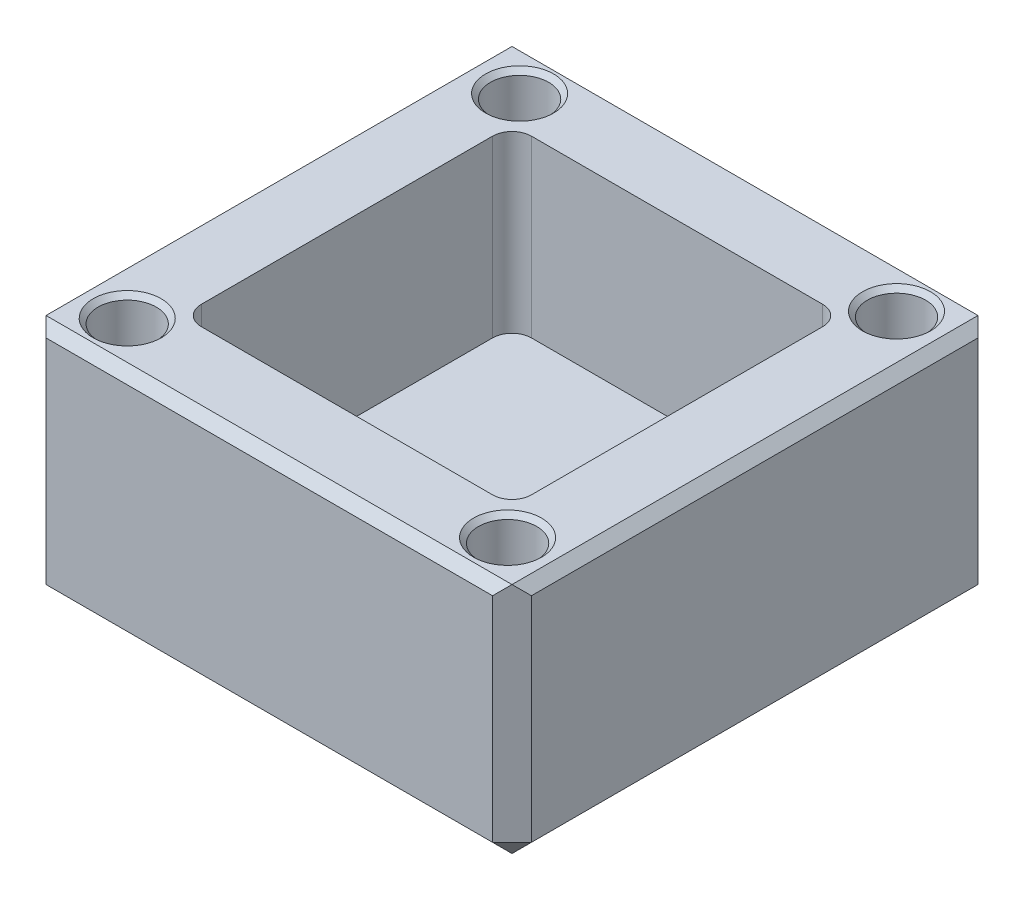
ISO-10303-21;
HEADER;
FILE_DESCRIPTION(('STEP AP214'),'2;1');
FILE_NAME('part.step','',(''),(''),'','','');
FILE_SCHEMA(('AUTOMOTIVE_DESIGN { 1 0 10303 214 1 1 1 1 }'));
ENDSEC;
DATA;
#1=APPLICATION_CONTEXT('core data for automotive mechanical design processes');
#2=APPLICATION_PROTOCOL_DEFINITION('international standard','automotive_design',2000,#1);
#3=PRODUCT_CONTEXT('',#1,'mechanical');
#4=PRODUCT('Part','Part','',(#3));
#5=PRODUCT_RELATED_PRODUCT_CATEGORY('part','',(#4));
#6=PRODUCT_DEFINITION_FORMATION('','',#4);
#7=PRODUCT_DEFINITION_CONTEXT('part definition',#1,'design');
#8=PRODUCT_DEFINITION('design','',#6,#7);
#9=PRODUCT_DEFINITION_SHAPE('','',#8);
#10=(LENGTH_UNIT() NAMED_UNIT(*) SI_UNIT(.MILLI.,.METRE.));
#11=(NAMED_UNIT(*) PLANE_ANGLE_UNIT() SI_UNIT($,.RADIAN.));
#12=(NAMED_UNIT(*) SI_UNIT($,.STERADIAN.) SOLID_ANGLE_UNIT());
#13=UNCERTAINTY_MEASURE_WITH_UNIT(LENGTH_MEASURE(1.E-05),#10,'distance_accuracy_value','');
#14=(GEOMETRIC_REPRESENTATION_CONTEXT(3) GLOBAL_UNCERTAINTY_ASSIGNED_CONTEXT((#13)) GLOBAL_UNIT_ASSIGNED_CONTEXT((#10,
#11,#12)) REPRESENTATION_CONTEXT('',''));
#15=CARTESIAN_POINT('',(0.,0.,0.));
#16=DIRECTION('',(0.,0.,1.));
#17=DIRECTION('',(1.,0.,0.));
#18=AXIS2_PLACEMENT_3D('',#15,#16,#17);
#19=CARTESIAN_POINT('',(25.,25.,-25.));
#20=DIRECTION('',(-1.,0.,0.));
#21=DIRECTION('',(0.,0.,1.));
#22=AXIS2_PLACEMENT_3D('',#19,#20,#21);
#23=PLANE('',#22);
#24=DIRECTION('',(0.,1.,0.));
#25=VECTOR('',#24,1.);
#26=CARTESIAN_POINT('',(25.,25.,-23.));
#27=LINE('',#26,#25);
#28=CARTESIAN_POINT('',(25.,2.,-23.));
#29=VERTEX_POINT('',#28);
#30=CARTESIAN_POINT('',(25.,24.,-23.));
#31=VERTEX_POINT('',#30);
#32=EDGE_CURVE('E198',#29,#31,#27,.T.);
#33=ORIENTED_EDGE('',*,*,#32,.T.);
#34=DIRECTION('',(0.,0.,1.));
#35=VECTOR('',#34,1.);
#36=CARTESIAN_POINT('',(25.,24.,23.));
#37=LINE('',#36,#35);
#38=CARTESIAN_POINT('',(25.,24.,23.));
#39=VERTEX_POINT('',#38);
#40=EDGE_CURVE('E309',#31,#39,#37,.T.);
#41=ORIENTED_EDGE('',*,*,#40,.T.);
#42=DIRECTION('',(0.,-1.,0.));
#43=VECTOR('',#42,1.);
#44=CARTESIAN_POINT('',(25.,25.,23.));
#45=LINE('',#44,#43);
#46=CARTESIAN_POINT('',(25.,2.,23.));
#47=VERTEX_POINT('',#46);
#48=EDGE_CURVE('E237',#39,#47,#45,.T.);
#49=ORIENTED_EDGE('',*,*,#48,.T.);
#50=DIRECTION('',(0.,0.,-1.));
#51=VECTOR('',#50,1.);
#52=CARTESIAN_POINT('',(25.,2.,-25.));
#53=LINE('',#52,#51);
#54=EDGE_CURVE('E239',#47,#29,#53,.T.);
#55=ORIENTED_EDGE('',*,*,#54,.T.);
#56=EDGE_LOOP('',(#33,#41,#49,#55));
#57=FACE_BOUND('',#56,.T.);
#58=ADVANCED_FACE('F39',(#57),#23,.F.);
#59=CARTESIAN_POINT('',(-25.,25.,-25.));
#60=DIRECTION('',(0.,0.,1.));
#61=DIRECTION('',(1.,0.,0.));
#62=AXIS2_PLACEMENT_3D('',#59,#60,#61);
#63=PLANE('',#62);
#64=DIRECTION('',(0.,1.,0.));
#65=VECTOR('',#64,1.);
#66=CARTESIAN_POINT('',(-23.,25.,-25.));
#67=LINE('',#66,#65);
#68=CARTESIAN_POINT('',(-23.,2.,-25.));
#69=VERTEX_POINT('',#68);
#70=CARTESIAN_POINT('',(-23.,24.,-25.));
#71=VERTEX_POINT('',#70);
#72=EDGE_CURVE('E216',#69,#71,#67,.T.);
#73=ORIENTED_EDGE('',*,*,#72,.T.);
#74=DIRECTION('',(1.,0.,0.));
#75=VECTOR('',#74,1.);
#76=CARTESIAN_POINT('',(23.,24.,-25.));
#77=LINE('',#76,#75);
#78=CARTESIAN_POINT('',(23.,24.,-25.));
#79=VERTEX_POINT('',#78);
#80=EDGE_CURVE('E186',#71,#79,#77,.T.);
#81=ORIENTED_EDGE('',*,*,#80,.T.);
#82=DIRECTION('',(0.,-1.,0.));
#83=VECTOR('',#82,1.);
#84=CARTESIAN_POINT('',(23.,25.,-25.));
#85=LINE('',#84,#83);
#86=CARTESIAN_POINT('',(23.,2.,-25.));
#87=VERTEX_POINT('',#86);
#88=EDGE_CURVE('E179',#79,#87,#85,.T.);
#89=ORIENTED_EDGE('',*,*,#88,.T.);
#90=DIRECTION('',(-1.,0.,0.));
#91=VECTOR('',#90,1.);
#92=CARTESIAN_POINT('',(-25.,2.,-25.));
#93=LINE('',#92,#91);
#94=EDGE_CURVE('E184',#87,#69,#93,.T.);
#95=ORIENTED_EDGE('',*,*,#94,.T.);
#96=EDGE_LOOP('',(#73,#81,#89,#95));
#97=FACE_BOUND('',#96,.T.);
#98=ADVANCED_FACE('F182',(#97),#63,.F.);
#99=CARTESIAN_POINT('',(-25.,25.,-25.));
#100=DIRECTION('',(1.,0.,0.));
#101=DIRECTION('',(0.,0.,-1.));
#102=AXIS2_PLACEMENT_3D('',#99,#100,#101);
#103=PLANE('',#102);
#104=DIRECTION('',(0.,1.,0.));
#105=VECTOR('',#104,1.);
#106=CARTESIAN_POINT('',(-25.,25.,23.));
#107=LINE('',#106,#105);
#108=CARTESIAN_POINT('',(-25.,2.,23.));
#109=VERTEX_POINT('',#108);
#110=CARTESIAN_POINT('',(-25.,24.,23.));
#111=VERTEX_POINT('',#110);
#112=EDGE_CURVE('E230',#109,#111,#107,.T.);
#113=ORIENTED_EDGE('',*,*,#112,.T.);
#114=DIRECTION('',(0.,0.,-1.));
#115=VECTOR('',#114,1.);
#116=CARTESIAN_POINT('',(-25.,24.,-23.));
#117=LINE('',#116,#115);
#118=CARTESIAN_POINT('',(-25.,24.,-23.));
#119=VERTEX_POINT('',#118);
#120=EDGE_CURVE('E290',#111,#119,#117,.T.);
#121=ORIENTED_EDGE('',*,*,#120,.T.);
#122=DIRECTION('',(0.,-1.,0.));
#123=VECTOR('',#122,1.);
#124=CARTESIAN_POINT('',(-25.,25.,-23.));
#125=LINE('',#124,#123);
#126=CARTESIAN_POINT('',(-25.,2.,-23.));
#127=VERTEX_POINT('',#126);
#128=EDGE_CURVE('E235',#119,#127,#125,.T.);
#129=ORIENTED_EDGE('',*,*,#128,.T.);
#130=DIRECTION('',(0.,0.,1.));
#131=VECTOR('',#130,1.);
#132=CARTESIAN_POINT('',(-25.,2.,-25.));
#133=LINE('',#132,#131);
#134=EDGE_CURVE('E233',#127,#109,#133,.T.);
#135=ORIENTED_EDGE('',*,*,#134,.T.);
#136=EDGE_LOOP('',(#113,#121,#129,#135));
#137=FACE_BOUND('',#136,.T.);
#138=ADVANCED_FACE('F387',(#137),#103,.F.);
#139=CARTESIAN_POINT('',(-25.,25.,25.));
#140=DIRECTION('',(0.,0.,-1.));
#141=DIRECTION('',(-1.,0.,0.));
#142=AXIS2_PLACEMENT_3D('',#139,#140,#141);
#143=PLANE('',#142);
#144=DIRECTION('',(0.,1.,0.));
#145=VECTOR('',#144,1.);
#146=CARTESIAN_POINT('',(23.,25.,25.));
#147=LINE('',#146,#145);
#148=CARTESIAN_POINT('',(23.,2.,25.));
#149=VERTEX_POINT('',#148);
#150=CARTESIAN_POINT('',(23.,24.,25.));
#151=VERTEX_POINT('',#150);
#152=EDGE_CURVE('E246',#149,#151,#147,.T.);
#153=ORIENTED_EDGE('',*,*,#152,.T.);
#154=DIRECTION('',(-1.,0.,0.));
#155=VECTOR('',#154,1.);
#156=CARTESIAN_POINT('',(-23.,24.,25.));
#157=LINE('',#156,#155);
#158=CARTESIAN_POINT('',(-23.,24.,25.));
#159=VERTEX_POINT('',#158);
#160=EDGE_CURVE('E307',#151,#159,#157,.T.);
#161=ORIENTED_EDGE('',*,*,#160,.T.);
#162=DIRECTION('',(0.,-1.,0.));
#163=VECTOR('',#162,1.);
#164=CARTESIAN_POINT('',(-23.,25.,25.));
#165=LINE('',#164,#163);
#166=CARTESIAN_POINT('',(-23.,2.,25.));
#167=VERTEX_POINT('',#166);
#168=EDGE_CURVE('E242',#159,#167,#165,.T.);
#169=ORIENTED_EDGE('',*,*,#168,.T.);
#170=DIRECTION('',(1.,0.,0.));
#171=VECTOR('',#170,1.);
#172=CARTESIAN_POINT('',(-25.,2.,25.));
#173=LINE('',#172,#171);
#174=EDGE_CURVE('E244',#167,#149,#173,.T.);
#175=ORIENTED_EDGE('',*,*,#174,.T.);
#176=EDGE_LOOP('',(#153,#161,#169,#175));
#177=FACE_BOUND('',#176,.T.);
#178=ADVANCED_FACE('F600',(#177),#143,.F.);
#179=CARTESIAN_POINT('',(0.,25.,0.));
#180=DIRECTION('',(0.,1.,0.));
#181=DIRECTION('',(0.,0.,1.));
#182=AXIS2_PLACEMENT_3D('',#179,#180,#181);
#183=PLANE('',#182);
#184=CARTESIAN_POINT('',(19.4340279778043,25.,-20.1741940399519));
#185=DIRECTION('',(0.,1.,0.));
#186=DIRECTION('',(0.,0.,1.));
#187=AXIS2_PLACEMENT_3D('',#184,#185,#186);
#188=CIRCLE('',#187,3.50000000000002);
#189=CARTESIAN_POINT('',(19.4340279778043,25.,-16.6741940399519));
#190=VERTEX_POINT('',#189);
#191=EDGE_CURVE('E356',#190,#190,#188,.F.);
#192=ORIENTED_EDGE('',*,*,#191,.T.);
#193=EDGE_LOOP('',(#192));
#194=FACE_BOUND('',#193,.T.);
#195=CARTESIAN_POINT('',(-19.4101736363355,25.,-20.1923444429938));
#196=DIRECTION('',(0.,1.,0.));
#197=DIRECTION('',(0.,0.,1.));
#198=AXIS2_PLACEMENT_3D('',#195,#196,#197);
#199=CIRCLE('',#198,3.50000000000002);
#200=CARTESIAN_POINT('',(-19.4101736363355,25.,-16.6923444429938));
#201=VERTEX_POINT('',#200);
#202=EDGE_CURVE('E353',#201,#201,#199,.F.);
#203=ORIENTED_EDGE('',*,*,#202,.T.);
#204=EDGE_LOOP('',(#203));
#205=FACE_BOUND('',#204,.T.);
#206=CARTESIAN_POINT('',(-19.5684293991816,25.,20.0664589384859));
#207=DIRECTION('',(0.,1.,0.));
#208=DIRECTION('',(0.,0.,1.));
#209=AXIS2_PLACEMENT_3D('',#206,#207,#208);
#210=CIRCLE('',#209,3.50000000000002);
#211=CARTESIAN_POINT('',(-19.5684293991816,25.,23.5664589384859));
#212=VERTEX_POINT('',#211);
#213=EDGE_CURVE('E350',#212,#212,#210,.F.);
#214=ORIENTED_EDGE('',*,*,#213,.T.);
#215=EDGE_LOOP('',(#214));
#216=FACE_BOUND('',#215,.T.);
#217=CARTESIAN_POINT('',(19.5918577536134,25.,20.046682357095));
#218=DIRECTION('',(0.,1.,0.));
#219=DIRECTION('',(0.,0.,1.));
#220=AXIS2_PLACEMENT_3D('',#217,#218,#219);
#221=CIRCLE('',#220,3.50000000000002);
#222=CARTESIAN_POINT('',(19.5918577536134,25.,23.5466823570951));
#223=VERTEX_POINT('',#222);
#224=EDGE_CURVE('E347',#223,#223,#221,.F.);
#225=ORIENTED_EDGE('',*,*,#224,.T.);
#226=EDGE_LOOP('',(#225));
#227=FACE_BOUND('',#226,.T.);
#228=DIRECTION('',(1.,0.,0.));
#229=VECTOR('',#228,1.);
#230=CARTESIAN_POINT('',(-17.,25.,17.));
#231=LINE('',#230,#229);
#232=CARTESIAN_POINT('',(-15.,25.,17.));
#233=VERTEX_POINT('',#232);
#234=CARTESIAN_POINT('',(15.,25.,17.));
#235=VERTEX_POINT('',#234);
#236=EDGE_CURVE('E562',#233,#235,#231,.T.);
#237=ORIENTED_EDGE('',*,*,#236,.F.);
#238=CARTESIAN_POINT('',(-15.,25.,15.));
#239=DIRECTION('',(0.,1.,0.));
#240=DIRECTION('',(0.,0.,1.));
#241=AXIS2_PLACEMENT_3D('',#238,#239,#240);
#242=CIRCLE('',#241,2.);
#243=CARTESIAN_POINT('',(-17.,25.,15.));
#244=VERTEX_POINT('',#243);
#245=EDGE_CURVE('E338',#233,#244,#242,.F.);
#246=ORIENTED_EDGE('',*,*,#245,.T.);
#247=DIRECTION('',(0.,0.,1.));
#248=VECTOR('',#247,1.);
#249=CARTESIAN_POINT('',(-17.,25.,-17.));
#250=LINE('',#249,#248);
#251=CARTESIAN_POINT('',(-17.,25.,-15.));
#252=VERTEX_POINT('',#251);
#253=EDGE_CURVE('E554',#252,#244,#250,.T.);
#254=ORIENTED_EDGE('',*,*,#253,.F.);
#255=CARTESIAN_POINT('',(-15.,25.,-15.));
#256=DIRECTION('',(0.,1.,0.));
#257=DIRECTION('',(0.,0.,1.));
#258=AXIS2_PLACEMENT_3D('',#255,#256,#257);
#259=CIRCLE('',#258,2.);
#260=CARTESIAN_POINT('',(-15.,25.,-17.));
#261=VERTEX_POINT('',#260);
#262=EDGE_CURVE('E63',#252,#261,#259,.F.);
#263=ORIENTED_EDGE('',*,*,#262,.T.);
#264=DIRECTION('',(1.,0.,0.));
#265=VECTOR('',#264,1.);
#266=CARTESIAN_POINT('',(-17.,25.,-17.));
#267=LINE('',#266,#265);
#268=CARTESIAN_POINT('',(15.,25.,-17.));
#269=VERTEX_POINT('',#268);
#270=EDGE_CURVE('E568',#261,#269,#267,.T.);
#271=ORIENTED_EDGE('',*,*,#270,.T.);
#272=CARTESIAN_POINT('',(15.,25.,-15.));
#273=DIRECTION('',(0.,1.,0.));
#274=DIRECTION('',(0.,0.,1.));
#275=AXIS2_PLACEMENT_3D('',#272,#273,#274);
#276=CIRCLE('',#275,2.);
#277=CARTESIAN_POINT('',(17.,25.,-15.));
#278=VERTEX_POINT('',#277);
#279=EDGE_CURVE('E55',#269,#278,#276,.F.);
#280=ORIENTED_EDGE('',*,*,#279,.T.);
#281=DIRECTION('',(0.,0.,1.));
#282=VECTOR('',#281,1.);
#283=CARTESIAN_POINT('',(17.,25.,-17.));
#284=LINE('',#283,#282);
#285=CARTESIAN_POINT('',(17.,25.,15.));
#286=VERTEX_POINT('',#285);
#287=EDGE_CURVE('E565',#278,#286,#284,.T.);
#288=ORIENTED_EDGE('',*,*,#287,.T.);
#289=CARTESIAN_POINT('',(15.,25.,15.));
#290=DIRECTION('',(0.,1.,0.));
#291=DIRECTION('',(0.,0.,1.));
#292=AXIS2_PLACEMENT_3D('',#289,#290,#291);
#293=CIRCLE('',#292,2.);
#294=EDGE_CURVE('E340',#286,#235,#293,.F.);
#295=ORIENTED_EDGE('',*,*,#294,.T.);
#296=EDGE_LOOP('',(#237,#246,#254,#263,#271,#280,#288,#295));
#297=FACE_BOUND('',#296,.T.);
#298=DIRECTION('',(-1.,0.,0.));
#299=VECTOR('',#298,1.);
#300=CARTESIAN_POINT('',(-23.,25.,-24.));
#301=LINE('',#300,#299);
#302=CARTESIAN_POINT('',(24.,25.,-24.));
#303=VERTEX_POINT('',#302);
#304=CARTESIAN_POINT('',(-24.,25.,-24.));
#305=VERTEX_POINT('',#304);
#306=EDGE_CURVE('E279',#303,#305,#301,.T.);
#307=ORIENTED_EDGE('',*,*,#306,.T.);
#308=DIRECTION('',(0.,0.,1.));
#309=VECTOR('',#308,1.);
#310=CARTESIAN_POINT('',(-24.,25.,23.));
#311=LINE('',#310,#309);
#312=CARTESIAN_POINT('',(-24.,25.,24.));
#313=VERTEX_POINT('',#312);
#314=EDGE_CURVE('E282',#305,#313,#311,.T.);
#315=ORIENTED_EDGE('',*,*,#314,.T.);
#316=DIRECTION('',(1.,0.,0.));
#317=VECTOR('',#316,1.);
#318=CARTESIAN_POINT('',(23.,25.,24.));
#319=LINE('',#318,#317);
#320=CARTESIAN_POINT('',(24.,25.,24.));
#321=VERTEX_POINT('',#320);
#322=EDGE_CURVE('E276',#313,#321,#319,.T.);
#323=ORIENTED_EDGE('',*,*,#322,.T.);
#324=DIRECTION('',(0.,0.,-1.));
#325=VECTOR('',#324,1.);
#326=CARTESIAN_POINT('',(24.,25.,-23.));
#327=LINE('',#326,#325);
#328=EDGE_CURVE('E249',#321,#303,#327,.T.);
#329=ORIENTED_EDGE('',*,*,#328,.T.);
#330=EDGE_LOOP('',(#307,#315,#323,#329));
#331=FACE_BOUND('',#330,.T.);
#332=ADVANCED_FACE('F596',(#194,#205,#216,#227,#297,#331),#183,.T.);
#333=CARTESIAN_POINT('',(0.,0.,0.));
#334=DIRECTION('',(0.,1.,0.));
#335=DIRECTION('',(0.,0.,1.));
#336=AXIS2_PLACEMENT_3D('',#333,#334,#335);
#337=PLANE('',#336);
#338=DIRECTION('',(0.,0.,-1.));
#339=VECTOR('',#338,1.);
#340=CARTESIAN_POINT('',(-23.,0.,0.));
#341=LINE('',#340,#339);
#342=CARTESIAN_POINT('',(-23.,0.,23.));
#343=VERTEX_POINT('',#342);
#344=CARTESIAN_POINT('',(-23.,0.,-23.));
#345=VERTEX_POINT('',#344);
#346=EDGE_CURVE('E225',#343,#345,#341,.T.);
#347=ORIENTED_EDGE('',*,*,#346,.T.);
#348=DIRECTION('',(1.,0.,0.));
#349=VECTOR('',#348,1.);
#350=CARTESIAN_POINT('',(0.,0.,-23.));
#351=LINE('',#350,#349);
#352=CARTESIAN_POINT('',(23.,0.,-23.));
#353=VERTEX_POINT('',#352);
#354=EDGE_CURVE('E227',#345,#353,#351,.T.);
#355=ORIENTED_EDGE('',*,*,#354,.T.);
#356=DIRECTION('',(0.,0.,1.));
#357=VECTOR('',#356,1.);
#358=CARTESIAN_POINT('',(23.,0.,0.));
#359=LINE('',#358,#357);
#360=CARTESIAN_POINT('',(23.,0.,23.));
#361=VERTEX_POINT('',#360);
#362=EDGE_CURVE('E223',#353,#361,#359,.T.);
#363=ORIENTED_EDGE('',*,*,#362,.T.);
#364=DIRECTION('',(-1.,0.,0.));
#365=VECTOR('',#364,1.);
#366=CARTESIAN_POINT('',(0.,0.,23.));
#367=LINE('',#366,#365);
#368=EDGE_CURVE('E218',#361,#343,#367,.T.);
#369=ORIENTED_EDGE('',*,*,#368,.T.);
#370=EDGE_LOOP('',(#347,#355,#363,#369));
#371=FACE_BOUND('',#370,.T.);
#372=ADVANCED_FACE('F599',(#371),#337,.F.);
#373=CARTESIAN_POINT('',(-17.,7.,17.));
#374=DIRECTION('',(0.,0.,1.));
#375=DIRECTION('',(1.,0.,0.));
#376=AXIS2_PLACEMENT_3D('',#373,#374,#375);
#377=PLANE('',#376);
#378=DIRECTION('',(1.,0.,0.));
#379=VECTOR('',#378,1.);
#380=CARTESIAN_POINT('',(-17.,7.,17.));
#381=LINE('',#380,#379);
#382=CARTESIAN_POINT('',(-15.,7.,17.));
#383=VERTEX_POINT('',#382);
#384=CARTESIAN_POINT('',(15.,7.,17.));
#385=VERTEX_POINT('',#384);
#386=EDGE_CURVE('E550',#383,#385,#381,.T.);
#387=ORIENTED_EDGE('',*,*,#386,.F.);
#388=DIRECTION('',(0.,1.,0.));
#389=VECTOR('',#388,1.);
#390=CARTESIAN_POINT('',(-15.,25.,17.));
#391=LINE('',#390,#389);
#392=EDGE_CURVE('E313',#383,#233,#391,.T.);
#393=ORIENTED_EDGE('',*,*,#392,.T.);
#394=ORIENTED_EDGE('',*,*,#236,.T.);
#395=DIRECTION('',(0.,1.,0.));
#396=VECTOR('',#395,1.);
#397=CARTESIAN_POINT('',(15.,7.,17.));
#398=LINE('',#397,#396);
#399=EDGE_CURVE('E311',#235,#385,#398,.F.);
#400=ORIENTED_EDGE('',*,*,#399,.T.);
#401=EDGE_LOOP('',(#387,#393,#394,#400));
#402=FACE_BOUND('',#401,.T.);
#403=ADVANCED_FACE('F582',(#402),#377,.F.);
#404=CARTESIAN_POINT('',(-17.,7.,-17.));
#405=DIRECTION('',(-1.,0.,0.));
#406=DIRECTION('',(0.,0.,1.));
#407=AXIS2_PLACEMENT_3D('',#404,#405,#406);
#408=PLANE('',#407);
#409=ORIENTED_EDGE('',*,*,#253,.T.);
#410=DIRECTION('',(0.,1.,0.));
#411=VECTOR('',#410,1.);
#412=CARTESIAN_POINT('',(-17.,7.,15.));
#413=LINE('',#412,#411);
#414=CARTESIAN_POINT('',(-17.,7.,15.));
#415=VERTEX_POINT('',#414);
#416=EDGE_CURVE('E319',#244,#415,#413,.F.);
#417=ORIENTED_EDGE('',*,*,#416,.T.);
#418=DIRECTION('',(0.,0.,1.));
#419=VECTOR('',#418,1.);
#420=CARTESIAN_POINT('',(-17.,7.,-17.));
#421=LINE('',#420,#419);
#422=CARTESIAN_POINT('',(-17.,7.,-15.));
#423=VERTEX_POINT('',#422);
#424=EDGE_CURVE('E190',#423,#415,#421,.T.);
#425=ORIENTED_EDGE('',*,*,#424,.F.);
#426=DIRECTION('',(0.,1.,0.));
#427=VECTOR('',#426,1.);
#428=CARTESIAN_POINT('',(-17.,7.,-15.));
#429=LINE('',#428,#427);
#430=EDGE_CURVE('E316',#423,#252,#429,.T.);
#431=ORIENTED_EDGE('',*,*,#430,.T.);
#432=EDGE_LOOP('',(#409,#417,#425,#431));
#433=FACE_BOUND('',#432,.T.);
#434=ADVANCED_FACE('F572',(#433),#408,.F.);
#435=CARTESIAN_POINT('',(-17.,7.,-17.));
#436=DIRECTION('',(0.,0.,1.));
#437=DIRECTION('',(1.,0.,0.));
#438=AXIS2_PLACEMENT_3D('',#435,#436,#437);
#439=PLANE('',#438);
#440=DIRECTION('',(1.,0.,0.));
#441=VECTOR('',#440,1.);
#442=CARTESIAN_POINT('',(-17.,7.,-17.));
#443=LINE('',#442,#441);
#444=CARTESIAN_POINT('',(-15.,7.,-17.));
#445=VERTEX_POINT('',#444);
#446=CARTESIAN_POINT('',(15.,7.,-17.));
#447=VERTEX_POINT('',#446);
#448=EDGE_CURVE('E557',#445,#447,#443,.T.);
#449=ORIENTED_EDGE('',*,*,#448,.T.);
#450=DIRECTION('',(0.,1.,0.));
#451=VECTOR('',#450,1.);
#452=CARTESIAN_POINT('',(15.,25.,-17.));
#453=LINE('',#452,#451);
#454=EDGE_CURVE('E336',#447,#269,#453,.T.);
#455=ORIENTED_EDGE('',*,*,#454,.T.);
#456=ORIENTED_EDGE('',*,*,#270,.F.);
#457=DIRECTION('',(0.,1.,0.));
#458=VECTOR('',#457,1.);
#459=CARTESIAN_POINT('',(-15.,7.,-17.));
#460=LINE('',#459,#458);
#461=EDGE_CURVE('E334',#261,#445,#460,.F.);
#462=ORIENTED_EDGE('',*,*,#461,.T.);
#463=EDGE_LOOP('',(#449,#455,#456,#462));
#464=FACE_BOUND('',#463,.T.);
#465=ADVANCED_FACE('F594',(#464),#439,.T.);
#466=CARTESIAN_POINT('',(17.,7.,-17.));
#467=DIRECTION('',(-1.,0.,0.));
#468=DIRECTION('',(0.,0.,1.));
#469=AXIS2_PLACEMENT_3D('',#466,#467,#468);
#470=PLANE('',#469);
#471=DIRECTION('',(0.,0.,1.));
#472=VECTOR('',#471,1.);
#473=CARTESIAN_POINT('',(17.,7.,-17.));
#474=LINE('',#473,#472);
#475=CARTESIAN_POINT('',(17.,7.,-15.));
#476=VERTEX_POINT('',#475);
#477=CARTESIAN_POINT('',(17.,7.,15.));
#478=VERTEX_POINT('',#477);
#479=EDGE_CURVE('E553',#476,#478,#474,.T.);
#480=ORIENTED_EDGE('',*,*,#479,.T.);
#481=DIRECTION('',(0.,1.,0.));
#482=VECTOR('',#481,1.);
#483=CARTESIAN_POINT('',(17.,7.,15.));
#484=LINE('',#483,#482);
#485=EDGE_CURVE('E331',#478,#286,#484,.T.);
#486=ORIENTED_EDGE('',*,*,#485,.T.);
#487=ORIENTED_EDGE('',*,*,#287,.F.);
#488=DIRECTION('',(0.,1.,0.));
#489=VECTOR('',#488,1.);
#490=CARTESIAN_POINT('',(17.,7.,-15.));
#491=LINE('',#490,#489);
#492=EDGE_CURVE('E329',#278,#476,#491,.F.);
#493=ORIENTED_EDGE('',*,*,#492,.T.);
#494=EDGE_LOOP('',(#480,#486,#487,#493));
#495=FACE_BOUND('',#494,.T.);
#496=ADVANCED_FACE('F589',(#495),#470,.T.);
#497=CARTESIAN_POINT('',(0.,7.,0.));
#498=DIRECTION('',(0.,-1.,0.));
#499=DIRECTION('',(0.,0.,-1.));
#500=AXIS2_PLACEMENT_3D('',#497,#498,#499);
#501=PLANE('',#500);
#502=ORIENTED_EDGE('',*,*,#424,.T.);
#503=CARTESIAN_POINT('',(-15.,7.,15.));
#504=DIRECTION('',(0.,-1.,0.));
#505=DIRECTION('',(0.,0.,-1.));
#506=AXIS2_PLACEMENT_3D('',#503,#504,#505);
#507=CIRCLE('',#506,2.);
#508=EDGE_CURVE('E327',#415,#383,#507,.F.);
#509=ORIENTED_EDGE('',*,*,#508,.T.);
#510=ORIENTED_EDGE('',*,*,#386,.T.);
#511=CARTESIAN_POINT('',(15.,7.,15.));
#512=DIRECTION('',(0.,-1.,0.));
#513=DIRECTION('',(0.,0.,-1.));
#514=AXIS2_PLACEMENT_3D('',#511,#512,#513);
#515=CIRCLE('',#514,2.);
#516=EDGE_CURVE('E325',#385,#478,#515,.F.);
#517=ORIENTED_EDGE('',*,*,#516,.T.);
#518=ORIENTED_EDGE('',*,*,#479,.F.);
#519=CARTESIAN_POINT('',(15.,7.,-15.));
#520=DIRECTION('',(0.,-1.,0.));
#521=DIRECTION('',(0.,0.,-1.));
#522=AXIS2_PLACEMENT_3D('',#519,#520,#521);
#523=CIRCLE('',#522,2.);
#524=EDGE_CURVE('E323',#476,#447,#523,.F.);
#525=ORIENTED_EDGE('',*,*,#524,.T.);
#526=ORIENTED_EDGE('',*,*,#448,.F.);
#527=CARTESIAN_POINT('',(-15.,7.,-15.));
#528=DIRECTION('',(0.,-1.,0.));
#529=DIRECTION('',(0.,0.,-1.));
#530=AXIS2_PLACEMENT_3D('',#527,#528,#529);
#531=CIRCLE('',#530,2.);
#532=EDGE_CURVE('E321',#445,#423,#531,.F.);
#533=ORIENTED_EDGE('',*,*,#532,.T.);
#534=EDGE_LOOP('',(#502,#509,#510,#517,#518,#525,#526,#533));
#535=FACE_BOUND('',#534,.T.);
#536=ADVANCED_FACE('F579',(#535),#501,.F.);
#537=CARTESIAN_POINT('',(-19.5684293991816,7.,20.0664589384859));
#538=DIRECTION('',(0.,1.,0.));
#539=DIRECTION('',(0.,0.,1.));
#540=AXIS2_PLACEMENT_3D('',#537,#538,#539);
#541=CYLINDRICAL_SURFACE('',#540,3.);
#542=CARTESIAN_POINT('',(-19.5684293991816,24.5,20.0664589384859));
#543=DIRECTION('',(0.,1.,0.));
#544=DIRECTION('',(0.,0.,1.));
#545=AXIS2_PLACEMENT_3D('',#542,#543,#544);
#546=CIRCLE('',#545,3.);
#547=CARTESIAN_POINT('',(-19.5684293991816,24.5,23.0664589384859));
#548=VERTEX_POINT('',#547);
#549=EDGE_CURVE('E48',#548,#548,#546,.T.);
#550=ORIENTED_EDGE('',*,*,#549,.T.);
#551=EDGE_LOOP('',(#550));
#552=FACE_BOUND('',#551,.T.);
#553=CARTESIAN_POINT('',(-19.5684293991816,7.,20.0664589384859));
#554=DIRECTION('',(0.,1.,0.));
#555=DIRECTION('',(0.,0.,1.));
#556=AXIS2_PLACEMENT_3D('',#553,#554,#555);
#557=CIRCLE('',#556,3.);
#558=CARTESIAN_POINT('',(-19.5684293991816,7.,23.0664589384859));
#559=VERTEX_POINT('',#558);
#560=EDGE_CURVE('E544',#559,#559,#557,.T.);
#561=ORIENTED_EDGE('',*,*,#560,.F.);
#562=EDGE_LOOP('',(#561));
#563=FACE_BOUND('',#562,.T.);
#564=ADVANCED_FACE('F364',(#552,#563),#541,.F.);
#565=CARTESIAN_POINT('',(-19.5684293991816,7.,20.0664589384859));
#566=DIRECTION('',(0.,1.,0.));
#567=DIRECTION('',(0.,0.,1.));
#568=AXIS2_PLACEMENT_3D('',#565,#566,#567);
#569=PLANE('',#568);
#570=ORIENTED_EDGE('',*,*,#560,.T.);
#571=EDGE_LOOP('',(#570));
#572=FACE_BOUND('',#571,.T.);
#573=ADVANCED_FACE('F672',(#572),#569,.T.);
#574=CARTESIAN_POINT('',(-19.4101736363355,7.,-20.1923444429938));
#575=DIRECTION('',(0.,1.,0.));
#576=DIRECTION('',(0.,0.,1.));
#577=AXIS2_PLACEMENT_3D('',#574,#575,#576);
#578=CYLINDRICAL_SURFACE('',#577,3.);
#579=CARTESIAN_POINT('',(-19.4101736363355,24.5,-20.1923444429938));
#580=DIRECTION('',(0.,1.,0.));
#581=DIRECTION('',(0.,0.,1.));
#582=AXIS2_PLACEMENT_3D('',#579,#580,#581);
#583=CIRCLE('',#582,3.);
#584=CARTESIAN_POINT('',(-19.4101736363355,24.5,-17.1923444429938));
#585=VERTEX_POINT('',#584);
#586=EDGE_CURVE('E359',#585,#585,#583,.T.);
#587=ORIENTED_EDGE('',*,*,#586,.T.);
#588=EDGE_LOOP('',(#587));
#589=FACE_BOUND('',#588,.T.);
#590=CARTESIAN_POINT('',(-19.4101736363355,7.,-20.1923444429938));
#591=DIRECTION('',(0.,1.,0.));
#592=DIRECTION('',(0.,0.,1.));
#593=AXIS2_PLACEMENT_3D('',#590,#591,#592);
#594=CIRCLE('',#593,3.);
#595=CARTESIAN_POINT('',(-19.4101736363355,7.,-17.1923444429938));
#596=VERTEX_POINT('',#595);
#597=EDGE_CURVE('E541',#596,#596,#594,.T.);
#598=ORIENTED_EDGE('',*,*,#597,.F.);
#599=EDGE_LOOP('',(#598));
#600=FACE_BOUND('',#599,.T.);
#601=ADVANCED_FACE('F682',(#589,#600),#578,.F.);
#602=CARTESIAN_POINT('',(-19.4101736363355,7.,-20.1923444429938));
#603=DIRECTION('',(0.,1.,0.));
#604=DIRECTION('',(0.,0.,1.));
#605=AXIS2_PLACEMENT_3D('',#602,#603,#604);
#606=PLANE('',#605);
#607=ORIENTED_EDGE('',*,*,#597,.T.);
#608=EDGE_LOOP('',(#607));
#609=FACE_BOUND('',#608,.T.);
#610=ADVANCED_FACE('F535',(#609),#606,.T.);
#611=CARTESIAN_POINT('',(19.4340279778043,7.,-20.1741940399519));
#612=DIRECTION('',(0.,1.,0.));
#613=DIRECTION('',(0.,0.,1.));
#614=AXIS2_PLACEMENT_3D('',#611,#612,#613);
#615=CYLINDRICAL_SURFACE('',#614,3.);
#616=CARTESIAN_POINT('',(19.4340279778043,24.5,-20.1741940399519));
#617=DIRECTION('',(0.,1.,0.));
#618=DIRECTION('',(0.,0.,1.));
#619=AXIS2_PLACEMENT_3D('',#616,#617,#618);
#620=CIRCLE('',#619,3.);
#621=CARTESIAN_POINT('',(19.4340279778043,24.5,-17.1741940399519));
#622=VERTEX_POINT('',#621);
#623=EDGE_CURVE('E344',#622,#622,#620,.T.);
#624=ORIENTED_EDGE('',*,*,#623,.T.);
#625=EDGE_LOOP('',(#624));
#626=FACE_BOUND('',#625,.T.);
#627=CARTESIAN_POINT('',(19.4340279778043,7.,-20.1741940399519));
#628=DIRECTION('',(0.,1.,0.));
#629=DIRECTION('',(0.,0.,1.));
#630=AXIS2_PLACEMENT_3D('',#627,#628,#629);
#631=CIRCLE('',#630,3.);
#632=CARTESIAN_POINT('',(19.4340279778043,7.,-17.1741940399519));
#633=VERTEX_POINT('',#632);
#634=EDGE_CURVE('E539',#633,#633,#631,.T.);
#635=ORIENTED_EDGE('',*,*,#634,.F.);
#636=EDGE_LOOP('',(#635));
#637=FACE_BOUND('',#636,.T.);
#638=ADVANCED_FACE('F531',(#626,#637),#615,.F.);
#639=CARTESIAN_POINT('',(19.4340279778043,7.,-20.1741940399519));
#640=DIRECTION('',(0.,1.,0.));
#641=DIRECTION('',(0.,0.,1.));
#642=AXIS2_PLACEMENT_3D('',#639,#640,#641);
#643=PLANE('',#642);
#644=ORIENTED_EDGE('',*,*,#634,.T.);
#645=EDGE_LOOP('',(#644));
#646=FACE_BOUND('',#645,.T.);
#647=ADVANCED_FACE('F534',(#646),#643,.T.);
#648=CARTESIAN_POINT('',(19.5918577536134,7.,20.046682357095));
#649=DIRECTION('',(0.,1.,0.));
#650=DIRECTION('',(0.,0.,1.));
#651=AXIS2_PLACEMENT_3D('',#648,#649,#650);
#652=CYLINDRICAL_SURFACE('',#651,3.);
#653=CARTESIAN_POINT('',(19.5918577536134,24.5,20.046682357095));
#654=DIRECTION('',(0.,1.,0.));
#655=DIRECTION('',(0.,0.,1.));
#656=AXIS2_PLACEMENT_3D('',#653,#654,#655);
#657=CIRCLE('',#656,3.);
#658=CARTESIAN_POINT('',(19.5918577536134,24.5,23.046682357095));
#659=VERTEX_POINT('',#658);
#660=EDGE_CURVE('E11',#659,#659,#657,.T.);
#661=ORIENTED_EDGE('',*,*,#660,.T.);
#662=EDGE_LOOP('',(#661));
#663=FACE_BOUND('',#662,.T.);
#664=CARTESIAN_POINT('',(19.5918577536134,7.,20.046682357095));
#665=DIRECTION('',(0.,1.,0.));
#666=DIRECTION('',(0.,0.,1.));
#667=AXIS2_PLACEMENT_3D('',#664,#665,#666);
#668=CIRCLE('',#667,3.);
#669=CARTESIAN_POINT('',(19.5918577536134,7.,23.046682357095));
#670=VERTEX_POINT('',#669);
#671=EDGE_CURVE('E273',#670,#670,#668,.T.);
#672=ORIENTED_EDGE('',*,*,#671,.F.);
#673=EDGE_LOOP('',(#672));
#674=FACE_BOUND('',#673,.T.);
#675=ADVANCED_FACE('F704',(#663,#674),#652,.F.);
#676=CARTESIAN_POINT('',(19.5918577536134,7.,20.046682357095));
#677=DIRECTION('',(0.,1.,0.));
#678=DIRECTION('',(0.,0.,1.));
#679=AXIS2_PLACEMENT_3D('',#676,#677,#678);
#680=PLANE('',#679);
#681=ORIENTED_EDGE('',*,*,#671,.T.);
#682=EDGE_LOOP('',(#681));
#683=FACE_BOUND('',#682,.T.);
#684=ADVANCED_FACE('F470',(#683),#680,.T.);
#685=CARTESIAN_POINT('',(25.,25.,23.));
#686=DIRECTION('',(-0.707106781186547,0.,-0.707106781186547));
#687=DIRECTION('',(0.,-1.,0.));
#688=AXIS2_PLACEMENT_3D('',#685,#686,#687);
#689=PLANE('',#688);
#690=DIRECTION('',(0.577350269189626,-0.577350269189626,-0.577350269189626));
#691=VECTOR('',#690,1.);
#692=CARTESIAN_POINT('',(24.6666666666667,24.3333333333333,23.3333333333333));
#693=LINE('',#692,#691);
#694=EDGE_CURVE('E302',#39,#321,#693,.F.);
#695=ORIENTED_EDGE('',*,*,#694,.T.);
#696=DIRECTION('',(0.577350269189626,0.577350269189626,-0.577350269189626));
#697=VECTOR('',#696,1.);
#698=CARTESIAN_POINT('',(24.6666666666667,25.6666666666667,23.3333333333333));
#699=LINE('',#698,#697);
#700=EDGE_CURVE('E305',#321,#151,#699,.F.);
#701=ORIENTED_EDGE('',*,*,#700,.T.);
#702=ORIENTED_EDGE('',*,*,#152,.F.);
#703=DIRECTION('',(0.707106781186547,0.,-0.707106781186547));
#704=VECTOR('',#703,1.);
#705=CARTESIAN_POINT('',(24.,2.,24.));
#706=LINE('',#705,#704);
#707=EDGE_CURVE('E267',#47,#149,#706,.F.);
#708=ORIENTED_EDGE('',*,*,#707,.F.);
#709=ORIENTED_EDGE('',*,*,#48,.F.);
#710=EDGE_LOOP('',(#695,#701,#702,#708,#709));
#711=FACE_BOUND('',#710,.T.);
#712=ADVANCED_FACE('F464',(#711),#689,.F.);
#713=CARTESIAN_POINT('',(-23.,25.,25.));
#714=DIRECTION('',(0.707106781186547,0.,-0.707106781186547));
#715=DIRECTION('',(0.,-1.,0.));
#716=AXIS2_PLACEMENT_3D('',#713,#714,#715);
#717=PLANE('',#716);
#718=DIRECTION('',(0.577350269189626,-0.577350269189626,0.577350269189626));
#719=VECTOR('',#718,1.);
#720=CARTESIAN_POINT('',(-23.3333333333333,24.3333333333333,24.6666666666667));
#721=LINE('',#720,#719);
#722=EDGE_CURVE('E285',#159,#313,#721,.F.);
#723=ORIENTED_EDGE('',*,*,#722,.T.);
#724=DIRECTION('',(0.577350269189626,0.577350269189626,0.577350269189626));
#725=VECTOR('',#724,1.);
#726=CARTESIAN_POINT('',(-23.3333333333333,25.6666666666667,24.6666666666667));
#727=LINE('',#726,#725);
#728=EDGE_CURVE('E288',#313,#111,#727,.F.);
#729=ORIENTED_EDGE('',*,*,#728,.T.);
#730=ORIENTED_EDGE('',*,*,#112,.F.);
#731=DIRECTION('',(0.707106781186547,0.,0.707106781186547));
#732=VECTOR('',#731,1.);
#733=CARTESIAN_POINT('',(-25.,2.,23.));
#734=LINE('',#733,#732);
#735=EDGE_CURVE('E264',#167,#109,#734,.F.);
#736=ORIENTED_EDGE('',*,*,#735,.F.);
#737=ORIENTED_EDGE('',*,*,#168,.F.);
#738=EDGE_LOOP('',(#723,#729,#730,#736,#737));
#739=FACE_BOUND('',#738,.T.);
#740=ADVANCED_FACE('F457',(#739),#717,.F.);
#741=CARTESIAN_POINT('',(-25.,2.,25.));
#742=DIRECTION('',(0.,0.707106781186547,-0.707106781186547));
#743=DIRECTION('',(1.,0.,0.));
#744=AXIS2_PLACEMENT_3D('',#741,#742,#743);
#745=PLANE('',#744);
#746=DIRECTION('',(0.,0.707106781186547,0.707106781186547));
#747=VECTOR('',#746,1.);
#748=CARTESIAN_POINT('',(23.,0.,23.));
#749=LINE('',#748,#747);
#750=EDGE_CURVE('E270',#149,#361,#749,.F.);
#751=ORIENTED_EDGE('',*,*,#750,.F.);
#752=ORIENTED_EDGE('',*,*,#174,.F.);
#753=DIRECTION('',(0.,-0.707106781186547,-0.707106781186547));
#754=VECTOR('',#753,1.);
#755=CARTESIAN_POINT('',(-23.,1.,24.));
#756=LINE('',#755,#754);
#757=EDGE_CURVE('E261',#343,#167,#756,.F.);
#758=ORIENTED_EDGE('',*,*,#757,.F.);
#759=ORIENTED_EDGE('',*,*,#368,.F.);
#760=EDGE_LOOP('',(#751,#752,#758,#759));
#761=FACE_BOUND('',#760,.T.);
#762=ADVANCED_FACE('F450',(#761),#745,.F.);
#763=CARTESIAN_POINT('',(23.,0.,23.));
#764=DIRECTION('',(0.577350269189626,-0.577350269189626,0.577350269189626));
#765=DIRECTION('',(0.707106781186547,0.,-0.707106781186547));
#766=AXIS2_PLACEMENT_3D('',#763,#764,#765);
#767=PLANE('',#766);
#768=ORIENTED_EDGE('',*,*,#707,.T.);
#769=ORIENTED_EDGE('',*,*,#750,.T.);
#770=DIRECTION('',(-0.707106781186548,-0.707106781186548,0.));
#771=VECTOR('',#770,1.);
#772=CARTESIAN_POINT('',(23.,0.,23.));
#773=LINE('',#772,#771);
#774=EDGE_CURVE('E258',#47,#361,#773,.T.);
#775=ORIENTED_EDGE('',*,*,#774,.F.);
#776=EDGE_LOOP('',(#768,#769,#775));
#777=FACE_BOUND('',#776,.T.);
#778=ADVANCED_FACE('F443',(#777),#767,.T.);
#779=CARTESIAN_POINT('',(-25.,2.,23.));
#780=DIRECTION('',(-0.577350269189626,-0.577350269189626,0.577350269189626));
#781=DIRECTION('',(0.707106781186547,0.,0.707106781186547));
#782=AXIS2_PLACEMENT_3D('',#779,#780,#781);
#783=PLANE('',#782);
#784=ORIENTED_EDGE('',*,*,#757,.T.);
#785=ORIENTED_EDGE('',*,*,#735,.T.);
#786=DIRECTION('',(-0.707106781186547,0.707106781186547,0.));
#787=VECTOR('',#786,1.);
#788=CARTESIAN_POINT('',(-25.,2.,23.));
#789=LINE('',#788,#787);
#790=EDGE_CURVE('E255',#343,#109,#789,.T.);
#791=ORIENTED_EDGE('',*,*,#790,.F.);
#792=EDGE_LOOP('',(#784,#785,#791));
#793=FACE_BOUND('',#792,.T.);
#794=ADVANCED_FACE('F436',(#793),#783,.T.);
#795=CARTESIAN_POINT('',(25.,2.,-25.));
#796=DIRECTION('',(-0.707106781186547,0.707106781186547,0.));
#797=DIRECTION('',(0.,0.,-1.));
#798=AXIS2_PLACEMENT_3D('',#795,#796,#797);
#799=PLANE('',#798);
#800=ORIENTED_EDGE('',*,*,#774,.T.);
#801=ORIENTED_EDGE('',*,*,#362,.F.);
#802=DIRECTION('',(0.707106781186547,0.707106781186547,0.));
#803=VECTOR('',#802,1.);
#804=CARTESIAN_POINT('',(23.,0.,-23.));
#805=LINE('',#804,#803);
#806=EDGE_CURVE('E202',#29,#353,#805,.F.);
#807=ORIENTED_EDGE('',*,*,#806,.F.);
#808=ORIENTED_EDGE('',*,*,#54,.F.);
#809=EDGE_LOOP('',(#800,#801,#807,#808));
#810=FACE_BOUND('',#809,.T.);
#811=ADVANCED_FACE('F430',(#810),#799,.F.);
#812=CARTESIAN_POINT('',(23.,25.,-25.));
#813=DIRECTION('',(-0.707106781186547,0.,0.707106781186547));
#814=DIRECTION('',(0.,-1.,0.));
#815=AXIS2_PLACEMENT_3D('',#812,#813,#814);
#816=PLANE('',#815);
#817=ORIENTED_EDGE('',*,*,#88,.F.);
#818=DIRECTION('',(-0.577350269189626,-0.577350269189626,-0.577350269189626));
#819=VECTOR('',#818,1.);
#820=CARTESIAN_POINT('',(23.3333333333333,24.3333333333333,-24.6666666666667));
#821=LINE('',#820,#819);
#822=EDGE_CURVE('E300',#79,#303,#821,.F.);
#823=ORIENTED_EDGE('',*,*,#822,.T.);
#824=DIRECTION('',(-0.577350269189626,0.577350269189626,-0.577350269189626));
#825=VECTOR('',#824,1.);
#826=CARTESIAN_POINT('',(23.3333333333333,25.6666666666667,-24.6666666666667));
#827=LINE('',#826,#825);
#828=EDGE_CURVE('E298',#303,#31,#827,.F.);
#829=ORIENTED_EDGE('',*,*,#828,.T.);
#830=ORIENTED_EDGE('',*,*,#32,.F.);
#831=DIRECTION('',(-0.707106781186547,0.,-0.707106781186547));
#832=VECTOR('',#831,1.);
#833=CARTESIAN_POINT('',(24.,2.,-24.));
#834=LINE('',#833,#832);
#835=EDGE_CURVE('E194',#87,#29,#834,.F.);
#836=ORIENTED_EDGE('',*,*,#835,.F.);
#837=EDGE_LOOP('',(#817,#823,#829,#830,#836));
#838=FACE_BOUND('',#837,.T.);
#839=ADVANCED_FACE('F196',(#838),#816,.F.);
#840=CARTESIAN_POINT('',(-25.,25.,-23.));
#841=DIRECTION('',(0.707106781186547,0.,0.707106781186547));
#842=DIRECTION('',(0.,-1.,0.));
#843=AXIS2_PLACEMENT_3D('',#840,#841,#842);
#844=PLANE('',#843);
#845=ORIENTED_EDGE('',*,*,#128,.F.);
#846=DIRECTION('',(-0.577350269189626,-0.577350269189626,0.577350269189626));
#847=VECTOR('',#846,1.);
#848=CARTESIAN_POINT('',(-24.6666666666667,24.3333333333333,-23.3333333333333));
#849=LINE('',#848,#847);
#850=EDGE_CURVE('E294',#119,#305,#849,.F.);
#851=ORIENTED_EDGE('',*,*,#850,.T.);
#852=DIRECTION('',(-0.577350269189626,0.577350269189626,0.577350269189626));
#853=VECTOR('',#852,1.);
#854=CARTESIAN_POINT('',(-24.6666666666667,25.6666666666667,-23.3333333333333));
#855=LINE('',#854,#853);
#856=EDGE_CURVE('E292',#305,#71,#855,.F.);
#857=ORIENTED_EDGE('',*,*,#856,.T.);
#858=ORIENTED_EDGE('',*,*,#72,.F.);
#859=DIRECTION('',(-0.707106781186547,0.,0.707106781186547));
#860=VECTOR('',#859,1.);
#861=CARTESIAN_POINT('',(-23.,2.,-25.));
#862=LINE('',#861,#860);
#863=EDGE_CURVE('E203',#127,#69,#862,.F.);
#864=ORIENTED_EDGE('',*,*,#863,.F.);
#865=EDGE_LOOP('',(#845,#851,#857,#858,#864));
#866=FACE_BOUND('',#865,.T.);
#867=ADVANCED_FACE('F417',(#866),#844,.F.);
#868=CARTESIAN_POINT('',(-25.,2.,-25.));
#869=DIRECTION('',(0.707106781186547,0.707106781186547,0.));
#870=DIRECTION('',(0.,0.,1.));
#871=AXIS2_PLACEMENT_3D('',#868,#869,#870);
#872=PLANE('',#871);
#873=ORIENTED_EDGE('',*,*,#790,.T.);
#874=ORIENTED_EDGE('',*,*,#134,.F.);
#875=DIRECTION('',(0.707106781186548,-0.707106781186548,0.));
#876=VECTOR('',#875,1.);
#877=CARTESIAN_POINT('',(-24.,1.,-23.));
#878=LINE('',#877,#876);
#879=EDGE_CURVE('E210',#345,#127,#878,.F.);
#880=ORIENTED_EDGE('',*,*,#879,.F.);
#881=ORIENTED_EDGE('',*,*,#346,.F.);
#882=EDGE_LOOP('',(#873,#874,#880,#881));
#883=FACE_BOUND('',#882,.T.);
#884=ADVANCED_FACE('F411',(#883),#872,.F.);
#885=CARTESIAN_POINT('',(23.,0.,-23.));
#886=DIRECTION('',(0.577350269189626,-0.577350269189626,-0.577350269189626));
#887=DIRECTION('',(-0.707106781186547,0.,-0.707106781186547));
#888=AXIS2_PLACEMENT_3D('',#885,#886,#887);
#889=PLANE('',#888);
#890=ORIENTED_EDGE('',*,*,#835,.T.);
#891=ORIENTED_EDGE('',*,*,#806,.T.);
#892=DIRECTION('',(0.,-0.707106781186547,0.707106781186547));
#893=VECTOR('',#892,1.);
#894=CARTESIAN_POINT('',(23.,0.,-23.));
#895=LINE('',#894,#893);
#896=EDGE_CURVE('E205',#87,#353,#895,.T.);
#897=ORIENTED_EDGE('',*,*,#896,.F.);
#898=EDGE_LOOP('',(#890,#891,#897));
#899=FACE_BOUND('',#898,.T.);
#900=ADVANCED_FACE('F206',(#899),#889,.T.);
#901=CARTESIAN_POINT('',(-23.,2.,-25.));
#902=DIRECTION('',(-0.577350269189626,-0.577350269189626,-0.577350269189626));
#903=DIRECTION('',(-0.707106781186547,0.,0.707106781186547));
#904=AXIS2_PLACEMENT_3D('',#901,#902,#903);
#905=PLANE('',#904);
#906=ORIENTED_EDGE('',*,*,#879,.T.);
#907=ORIENTED_EDGE('',*,*,#863,.T.);
#908=DIRECTION('',(0.,0.707106781186547,-0.707106781186547));
#909=VECTOR('',#908,1.);
#910=CARTESIAN_POINT('',(-23.,2.,-25.));
#911=LINE('',#910,#909);
#912=EDGE_CURVE('E211',#345,#69,#911,.T.);
#913=ORIENTED_EDGE('',*,*,#912,.F.);
#914=EDGE_LOOP('',(#906,#907,#913));
#915=FACE_BOUND('',#914,.T.);
#916=ADVANCED_FACE('F399',(#915),#905,.T.);
#917=CARTESIAN_POINT('',(-25.,2.,-25.));
#918=DIRECTION('',(0.,0.707106781186547,0.707106781186547));
#919=DIRECTION('',(-1.,0.,0.));
#920=AXIS2_PLACEMENT_3D('',#917,#918,#919);
#921=PLANE('',#920);
#922=ORIENTED_EDGE('',*,*,#896,.T.);
#923=ORIENTED_EDGE('',*,*,#354,.F.);
#924=ORIENTED_EDGE('',*,*,#912,.T.);
#925=ORIENTED_EDGE('',*,*,#94,.F.);
#926=EDGE_LOOP('',(#922,#923,#924,#925));
#927=FACE_BOUND('',#926,.T.);
#928=ADVANCED_FACE('F213',(#927),#921,.F.);
#929=CARTESIAN_POINT('',(-24.,25.,0.));
#930=DIRECTION('',(-0.707106781186547,0.707106781186547,0.));
#931=DIRECTION('',(0.,0.,-1.));
#932=AXIS2_PLACEMENT_3D('',#929,#930,#931);
#933=PLANE('',#932);
#934=ORIENTED_EDGE('',*,*,#850,.F.);
#935=ORIENTED_EDGE('',*,*,#120,.F.);
#936=ORIENTED_EDGE('',*,*,#728,.F.);
#937=ORIENTED_EDGE('',*,*,#314,.F.);
#938=EDGE_LOOP('',(#934,#935,#936,#937));
#939=FACE_BOUND('',#938,.T.);
#940=ADVANCED_FACE('F398',(#939),#933,.T.);
#941=CARTESIAN_POINT('',(0.,25.,-24.));
#942=DIRECTION('',(0.,0.707106781186547,-0.707106781186547));
#943=DIRECTION('',(1.,0.,0.));
#944=AXIS2_PLACEMENT_3D('',#941,#942,#943);
#945=PLANE('',#944);
#946=ORIENTED_EDGE('',*,*,#822,.F.);
#947=ORIENTED_EDGE('',*,*,#80,.F.);
#948=ORIENTED_EDGE('',*,*,#856,.F.);
#949=ORIENTED_EDGE('',*,*,#306,.F.);
#950=EDGE_LOOP('',(#946,#947,#948,#949));
#951=FACE_BOUND('',#950,.T.);
#952=ADVANCED_FACE('F477',(#951),#945,.T.);
#953=CARTESIAN_POINT('',(0.,25.,24.));
#954=DIRECTION('',(0.,0.707106781186547,0.707106781186547));
#955=DIRECTION('',(-1.,0.,0.));
#956=AXIS2_PLACEMENT_3D('',#953,#954,#955);
#957=PLANE('',#956);
#958=ORIENTED_EDGE('',*,*,#722,.F.);
#959=ORIENTED_EDGE('',*,*,#160,.F.);
#960=ORIENTED_EDGE('',*,*,#700,.F.);
#961=ORIENTED_EDGE('',*,*,#322,.F.);
#962=EDGE_LOOP('',(#958,#959,#960,#961));
#963=FACE_BOUND('',#962,.T.);
#964=ADVANCED_FACE('F484',(#963),#957,.T.);
#965=CARTESIAN_POINT('',(24.,25.,0.));
#966=DIRECTION('',(0.707106781186547,0.707106781186547,0.));
#967=DIRECTION('',(0.,0.,1.));
#968=AXIS2_PLACEMENT_3D('',#965,#966,#967);
#969=PLANE('',#968);
#970=ORIENTED_EDGE('',*,*,#694,.F.);
#971=ORIENTED_EDGE('',*,*,#40,.F.);
#972=ORIENTED_EDGE('',*,*,#828,.F.);
#973=ORIENTED_EDGE('',*,*,#328,.F.);
#974=EDGE_LOOP('',(#970,#971,#972,#973));
#975=FACE_BOUND('',#974,.T.);
#976=ADVANCED_FACE('F491',(#975),#969,.T.);
#977=CARTESIAN_POINT('',(-15.,7.,15.));
#978=DIRECTION('',(0.,-1.,0.));
#979=DIRECTION('',(0.,0.,-1.));
#980=AXIS2_PLACEMENT_3D('',#977,#978,#979);
#981=CYLINDRICAL_SURFACE('',#980,2.);
#982=ORIENTED_EDGE('',*,*,#508,.F.);
#983=ORIENTED_EDGE('',*,*,#416,.F.);
#984=ORIENTED_EDGE('',*,*,#245,.F.);
#985=ORIENTED_EDGE('',*,*,#392,.F.);
#986=EDGE_LOOP('',(#982,#983,#984,#985));
#987=FACE_BOUND('',#986,.T.);
#988=ADVANCED_FACE('F498',(#987),#981,.F.);
#989=CARTESIAN_POINT('',(15.,7.,15.));
#990=DIRECTION('',(0.,1.,0.));
#991=DIRECTION('',(0.,0.,1.));
#992=AXIS2_PLACEMENT_3D('',#989,#990,#991);
#993=CYLINDRICAL_SURFACE('',#992,2.);
#994=ORIENTED_EDGE('',*,*,#516,.F.);
#995=ORIENTED_EDGE('',*,*,#399,.F.);
#996=ORIENTED_EDGE('',*,*,#294,.F.);
#997=ORIENTED_EDGE('',*,*,#485,.F.);
#998=EDGE_LOOP('',(#994,#995,#996,#997));
#999=FACE_BOUND('',#998,.T.);
#1000=ADVANCED_FACE('F502',(#999),#993,.F.);
#1001=CARTESIAN_POINT('',(15.,7.,-15.));
#1002=DIRECTION('',(0.,-1.,0.));
#1003=DIRECTION('',(0.,0.,-1.));
#1004=AXIS2_PLACEMENT_3D('',#1001,#1002,#1003);
#1005=CYLINDRICAL_SURFACE('',#1004,2.);
#1006=ORIENTED_EDGE('',*,*,#524,.F.);
#1007=ORIENTED_EDGE('',*,*,#492,.F.);
#1008=ORIENTED_EDGE('',*,*,#279,.F.);
#1009=ORIENTED_EDGE('',*,*,#454,.F.);
#1010=EDGE_LOOP('',(#1006,#1007,#1008,#1009));
#1011=FACE_BOUND('',#1010,.T.);
#1012=ADVANCED_FACE('F506',(#1011),#1005,.F.);
#1013=CARTESIAN_POINT('',(-15.,7.,-15.));
#1014=DIRECTION('',(0.,1.,0.));
#1015=DIRECTION('',(0.,0.,1.));
#1016=AXIS2_PLACEMENT_3D('',#1013,#1014,#1015);
#1017=CYLINDRICAL_SURFACE('',#1016,2.);
#1018=ORIENTED_EDGE('',*,*,#532,.F.);
#1019=ORIENTED_EDGE('',*,*,#461,.F.);
#1020=ORIENTED_EDGE('',*,*,#262,.F.);
#1021=ORIENTED_EDGE('',*,*,#430,.F.);
#1022=EDGE_LOOP('',(#1018,#1019,#1020,#1021));
#1023=FACE_BOUND('',#1022,.T.);
#1024=ADVANCED_FACE('F510',(#1023),#1017,.F.);
#1025=CARTESIAN_POINT('',(19.4340279778043,24.5,-20.1741940399519));
#1026=DIRECTION('',(0.,1.,0.));
#1027=DIRECTION('',(0.,0.,1.));
#1028=AXIS2_PLACEMENT_3D('',#1025,#1026,#1027);
#1029=CONICAL_SURFACE('',#1028,3.,0.785398163397453);
#1030=ORIENTED_EDGE('',*,*,#191,.F.);
#1031=EDGE_LOOP('',(#1030));
#1032=FACE_BOUND('',#1031,.T.);
#1033=ORIENTED_EDGE('',*,*,#623,.F.);
#1034=EDGE_LOOP('',(#1033));
#1035=FACE_BOUND('',#1034,.T.);
#1036=ADVANCED_FACE('F376',(#1032,#1035),#1029,.F.);
#1037=CARTESIAN_POINT('',(-19.4101736363355,24.5,-20.1923444429938));
#1038=DIRECTION('',(0.,1.,0.));
#1039=DIRECTION('',(0.,0.,1.));
#1040=AXIS2_PLACEMENT_3D('',#1037,#1038,#1039);
#1041=CONICAL_SURFACE('',#1040,3.,0.785398163397453);
#1042=ORIENTED_EDGE('',*,*,#202,.F.);
#1043=EDGE_LOOP('',(#1042));
#1044=FACE_BOUND('',#1043,.T.);
#1045=ORIENTED_EDGE('',*,*,#586,.F.);
#1046=EDGE_LOOP('',(#1045));
#1047=FACE_BOUND('',#1046,.T.);
#1048=ADVANCED_FACE('F369',(#1044,#1047),#1041,.F.);
#1049=CARTESIAN_POINT('',(-19.5684293991816,24.5,20.0664589384859));
#1050=DIRECTION('',(0.,1.,0.));
#1051=DIRECTION('',(0.,0.,1.));
#1052=AXIS2_PLACEMENT_3D('',#1049,#1050,#1051);
#1053=CONICAL_SURFACE('',#1052,3.,0.785398163397453);
#1054=ORIENTED_EDGE('',*,*,#213,.F.);
#1055=EDGE_LOOP('',(#1054));
#1056=FACE_BOUND('',#1055,.T.);
#1057=ORIENTED_EDGE('',*,*,#549,.F.);
#1058=EDGE_LOOP('',(#1057));
#1059=FACE_BOUND('',#1058,.T.);
#1060=ADVANCED_FACE('F367',(#1056,#1059),#1053,.F.);
#1061=CARTESIAN_POINT('',(19.5918577536134,24.5,20.046682357095));
#1062=DIRECTION('',(0.,1.,0.));
#1063=DIRECTION('',(0.,0.,1.));
#1064=AXIS2_PLACEMENT_3D('',#1061,#1062,#1063);
#1065=CONICAL_SURFACE('',#1064,3.,0.785398163397453);
#1066=ORIENTED_EDGE('',*,*,#224,.F.);
#1067=EDGE_LOOP('',(#1066));
#1068=FACE_BOUND('',#1067,.T.);
#1069=ORIENTED_EDGE('',*,*,#660,.F.);
#1070=EDGE_LOOP('',(#1069));
#1071=FACE_BOUND('',#1070,.T.);
#1072=ADVANCED_FACE('F42',(#1068,#1071),#1065,.F.);
#1073=CLOSED_SHELL('',(#58,#98,#138,#178,#332,#372,#403,#434,#465,#496,#536,#564,#573,#601,#610,
#638,#647,#675,#684,#712,#740,#762,#778,#794,#811,#839,#867,#884,#900,#916,#928,#940,#952,#964,
#976,#988,#1000,#1012,#1024,#1036,#1048,#1060,#1072));
#1074=MANIFOLD_SOLID_BREP('B2',#1073);
#1075=ADVANCED_BREP_SHAPE_REPRESENTATION('',(#18,#1074),#14);
#1076=SHAPE_DEFINITION_REPRESENTATION(#9,#1075);
ENDSEC;
END-ISO-10303-21;
